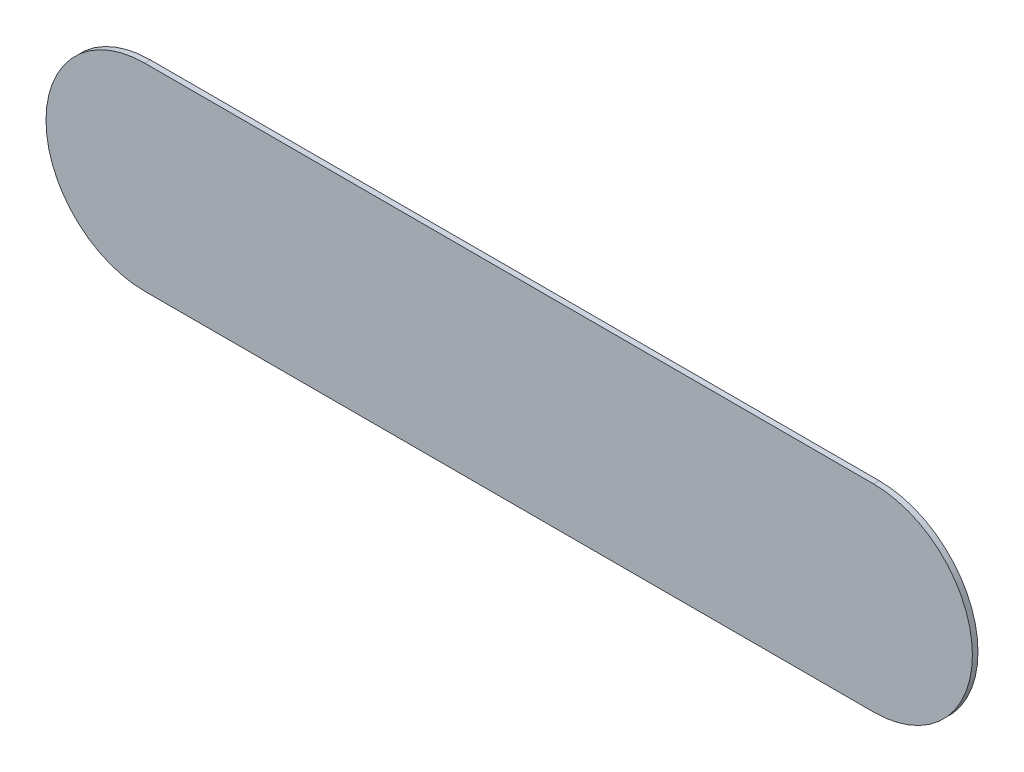
ISO-10303-21;
HEADER;
FILE_DESCRIPTION(('STEP AP214'),'2;1');
FILE_NAME('part.step','',(''),(''),'','','');
FILE_SCHEMA(('AUTOMOTIVE_DESIGN { 1 0 10303 214 1 1 1 1 }'));
ENDSEC;
DATA;
#1=APPLICATION_CONTEXT('core data for automotive mechanical design processes');
#2=APPLICATION_PROTOCOL_DEFINITION('international standard','automotive_design',2000,#1);
#3=PRODUCT_CONTEXT('',#1,'mechanical');
#4=PRODUCT('Part','Part','',(#3));
#5=PRODUCT_RELATED_PRODUCT_CATEGORY('part','',(#4));
#6=PRODUCT_DEFINITION_FORMATION('','',#4);
#7=PRODUCT_DEFINITION_CONTEXT('part definition',#1,'design');
#8=PRODUCT_DEFINITION('design','',#6,#7);
#9=PRODUCT_DEFINITION_SHAPE('','',#8);
#10=(LENGTH_UNIT() NAMED_UNIT(*) SI_UNIT(.MILLI.,.METRE.));
#11=(NAMED_UNIT(*) PLANE_ANGLE_UNIT() SI_UNIT($,.RADIAN.));
#12=(NAMED_UNIT(*) SI_UNIT($,.STERADIAN.) SOLID_ANGLE_UNIT());
#13=UNCERTAINTY_MEASURE_WITH_UNIT(LENGTH_MEASURE(1.E-05),#10,'distance_accuracy_value','');
#14=(GEOMETRIC_REPRESENTATION_CONTEXT(3) GLOBAL_UNCERTAINTY_ASSIGNED_CONTEXT((#13)) GLOBAL_UNIT_ASSIGNED_CONTEXT((#10,
#11,#12)) REPRESENTATION_CONTEXT('',''));
#15=CARTESIAN_POINT('',(0.,0.,0.));
#16=DIRECTION('',(0.,0.,1.));
#17=DIRECTION('',(1.,0.,0.));
#18=AXIS2_PLACEMENT_3D('',#15,#16,#17);
#19=CARTESIAN_POINT('',(0.,0.,0.5));
#20=DIRECTION('',(0.,0.,-1.));
#21=DIRECTION('',(-1.,0.,0.));
#22=AXIS2_PLACEMENT_3D('',#19,#20,#21);
#23=CYLINDRICAL_SURFACE('',#22,8.81);
#24=CARTESIAN_POINT('',(0.,0.,0.));
#25=DIRECTION('',(0.,0.,1.));
#26=DIRECTION('',(1.,0.,0.));
#27=AXIS2_PLACEMENT_3D('',#24,#25,#26);
#28=CIRCLE('',#27,8.81);
#29=CARTESIAN_POINT('',(0.,8.81,0.));
#30=VERTEX_POINT('',#29);
#31=CARTESIAN_POINT('',(0.,-8.81,0.));
#32=VERTEX_POINT('',#31);
#33=EDGE_CURVE('E97',#30,#32,#28,.T.);
#34=ORIENTED_EDGE('',*,*,#33,.T.);
#35=DIRECTION('',(0.,0.,-1.));
#36=VECTOR('',#35,1.);
#37=CARTESIAN_POINT('',(0.,-8.81,0.5));
#38=LINE('',#37,#36);
#39=CARTESIAN_POINT('',(0.,-8.81,0.5));
#40=VERTEX_POINT('',#39);
#41=EDGE_CURVE('E11',#40,#32,#38,.T.);
#42=ORIENTED_EDGE('',*,*,#41,.F.);
#43=CARTESIAN_POINT('',(0.,0.,0.5));
#44=DIRECTION('',(0.,0.,1.));
#45=DIRECTION('',(1.,0.,0.));
#46=AXIS2_PLACEMENT_3D('',#43,#44,#45);
#47=CIRCLE('',#46,8.81);
#48=CARTESIAN_POINT('',(0.,8.81,0.5));
#49=VERTEX_POINT('',#48);
#50=EDGE_CURVE('E85',#49,#40,#47,.T.);
#51=ORIENTED_EDGE('',*,*,#50,.F.);
#52=DIRECTION('',(0.,0.,-1.));
#53=VECTOR('',#52,1.);
#54=CARTESIAN_POINT('',(0.,8.81,0.5));
#55=LINE('',#54,#53);
#56=EDGE_CURVE('E93',#49,#30,#55,.T.);
#57=ORIENTED_EDGE('',*,*,#56,.T.);
#58=EDGE_LOOP('',(#34,#42,#51,#57));
#59=FACE_BOUND('',#58,.T.);
#60=ADVANCED_FACE('F34',(#59),#23,.T.);
#61=CARTESIAN_POINT('',(0.,-8.81,0.5));
#62=DIRECTION('',(0.,1.,0.));
#63=DIRECTION('',(0.,0.,1.));
#64=AXIS2_PLACEMENT_3D('',#61,#62,#63);
#65=PLANE('',#64);
#66=DIRECTION('',(1.,0.,0.));
#67=VECTOR('',#66,1.);
#68=CARTESIAN_POINT('',(0.,-8.81,0.));
#69=LINE('',#68,#67);
#70=CARTESIAN_POINT('',(65.,-8.81,0.));
#71=VERTEX_POINT('',#70);
#72=EDGE_CURVE('E89',#32,#71,#69,.T.);
#73=ORIENTED_EDGE('',*,*,#72,.T.);
#74=DIRECTION('',(0.,0.,-1.));
#75=VECTOR('',#74,1.);
#76=CARTESIAN_POINT('',(65.,-8.81,0.5));
#77=LINE('',#76,#75);
#78=CARTESIAN_POINT('',(65.,-8.81,0.5));
#79=VERTEX_POINT('',#78);
#80=EDGE_CURVE('E42',#79,#71,#77,.T.);
#81=ORIENTED_EDGE('',*,*,#80,.F.);
#82=DIRECTION('',(1.,0.,0.));
#83=VECTOR('',#82,1.);
#84=CARTESIAN_POINT('',(0.,-8.81,0.5));
#85=LINE('',#84,#83);
#86=EDGE_CURVE('E80',#40,#79,#85,.T.);
#87=ORIENTED_EDGE('',*,*,#86,.F.);
#88=ORIENTED_EDGE('',*,*,#41,.T.);
#89=EDGE_LOOP('',(#73,#81,#87,#88));
#90=FACE_BOUND('',#89,.T.);
#91=ADVANCED_FACE('F88',(#90),#65,.F.);
#92=CARTESIAN_POINT('',(65.,0.,0.5));
#93=DIRECTION('',(0.,0.,-1.));
#94=DIRECTION('',(-1.,0.,0.));
#95=AXIS2_PLACEMENT_3D('',#92,#93,#94);
#96=CYLINDRICAL_SURFACE('',#95,8.81);
#97=CARTESIAN_POINT('',(65.,0.,0.));
#98=DIRECTION('',(0.,0.,1.));
#99=DIRECTION('',(1.,0.,0.));
#100=AXIS2_PLACEMENT_3D('',#97,#98,#99);
#101=CIRCLE('',#100,8.81);
#102=CARTESIAN_POINT('',(65.,8.81,0.));
#103=VERTEX_POINT('',#102);
#104=EDGE_CURVE('E67',#71,#103,#101,.T.);
#105=ORIENTED_EDGE('',*,*,#104,.T.);
#106=DIRECTION('',(0.,0.,-1.));
#107=VECTOR('',#106,1.);
#108=CARTESIAN_POINT('',(65.,8.81,0.5));
#109=LINE('',#108,#107);
#110=CARTESIAN_POINT('',(65.,8.81,0.5));
#111=VERTEX_POINT('',#110);
#112=EDGE_CURVE('E90',#111,#103,#109,.T.);
#113=ORIENTED_EDGE('',*,*,#112,.F.);
#114=CARTESIAN_POINT('',(65.,0.,0.5));
#115=DIRECTION('',(0.,0.,1.));
#116=DIRECTION('',(1.,0.,0.));
#117=AXIS2_PLACEMENT_3D('',#114,#115,#116);
#118=CIRCLE('',#117,8.81);
#119=EDGE_CURVE('E83',#79,#111,#118,.T.);
#120=ORIENTED_EDGE('',*,*,#119,.F.);
#121=ORIENTED_EDGE('',*,*,#80,.T.);
#122=EDGE_LOOP('',(#105,#113,#120,#121));
#123=FACE_BOUND('',#122,.T.);
#124=ADVANCED_FACE('F91',(#123),#96,.T.);
#125=CARTESIAN_POINT('',(0.,8.81,0.5));
#126=DIRECTION('',(0.,-1.,0.));
#127=DIRECTION('',(0.,0.,-1.));
#128=AXIS2_PLACEMENT_3D('',#125,#126,#127);
#129=PLANE('',#128);
#130=DIRECTION('',(-1.,0.,0.));
#131=VECTOR('',#130,1.);
#132=CARTESIAN_POINT('',(0.,8.81,0.));
#133=LINE('',#132,#131);
#134=EDGE_CURVE('E73',#103,#30,#133,.T.);
#135=ORIENTED_EDGE('',*,*,#134,.T.);
#136=ORIENTED_EDGE('',*,*,#56,.F.);
#137=DIRECTION('',(-1.,0.,0.));
#138=VECTOR('',#137,1.);
#139=CARTESIAN_POINT('',(0.,8.81,0.5));
#140=LINE('',#139,#138);
#141=EDGE_CURVE('E50',#111,#49,#140,.T.);
#142=ORIENTED_EDGE('',*,*,#141,.F.);
#143=ORIENTED_EDGE('',*,*,#112,.T.);
#144=EDGE_LOOP('',(#135,#136,#142,#143));
#145=FACE_BOUND('',#144,.T.);
#146=ADVANCED_FACE('F104',(#145),#129,.F.);
#147=CARTESIAN_POINT('',(0.,0.,0.5));
#148=DIRECTION('',(0.,0.,1.));
#149=DIRECTION('',(1.,0.,0.));
#150=AXIS2_PLACEMENT_3D('',#147,#148,#149);
#151=PLANE('',#150);
#152=ORIENTED_EDGE('',*,*,#50,.T.);
#153=ORIENTED_EDGE('',*,*,#86,.T.);
#154=ORIENTED_EDGE('',*,*,#119,.T.);
#155=ORIENTED_EDGE('',*,*,#141,.T.);
#156=EDGE_LOOP('',(#152,#153,#154,#155));
#157=FACE_BOUND('',#156,.T.);
#158=ADVANCED_FACE('F81',(#157),#151,.T.);
#159=CARTESIAN_POINT('',(0.,0.,0.));
#160=DIRECTION('',(0.,0.,1.));
#161=DIRECTION('',(1.,0.,0.));
#162=AXIS2_PLACEMENT_3D('',#159,#160,#161);
#163=PLANE('',#162);
#164=ORIENTED_EDGE('',*,*,#33,.F.);
#165=ORIENTED_EDGE('',*,*,#134,.F.);
#166=ORIENTED_EDGE('',*,*,#104,.F.);
#167=ORIENTED_EDGE('',*,*,#72,.F.);
#168=EDGE_LOOP('',(#164,#165,#166,#167));
#169=FACE_BOUND('',#168,.T.);
#170=ADVANCED_FACE('F107',(#169),#163,.F.);
#171=CLOSED_SHELL('',(#60,#91,#124,#146,#158,#170));
#172=MANIFOLD_SOLID_BREP('B2',#171);
#173=ADVANCED_BREP_SHAPE_REPRESENTATION('',(#18,#172),#14);
#174=SHAPE_DEFINITION_REPRESENTATION(#9,#173);
ENDSEC;
END-ISO-10303-21;
